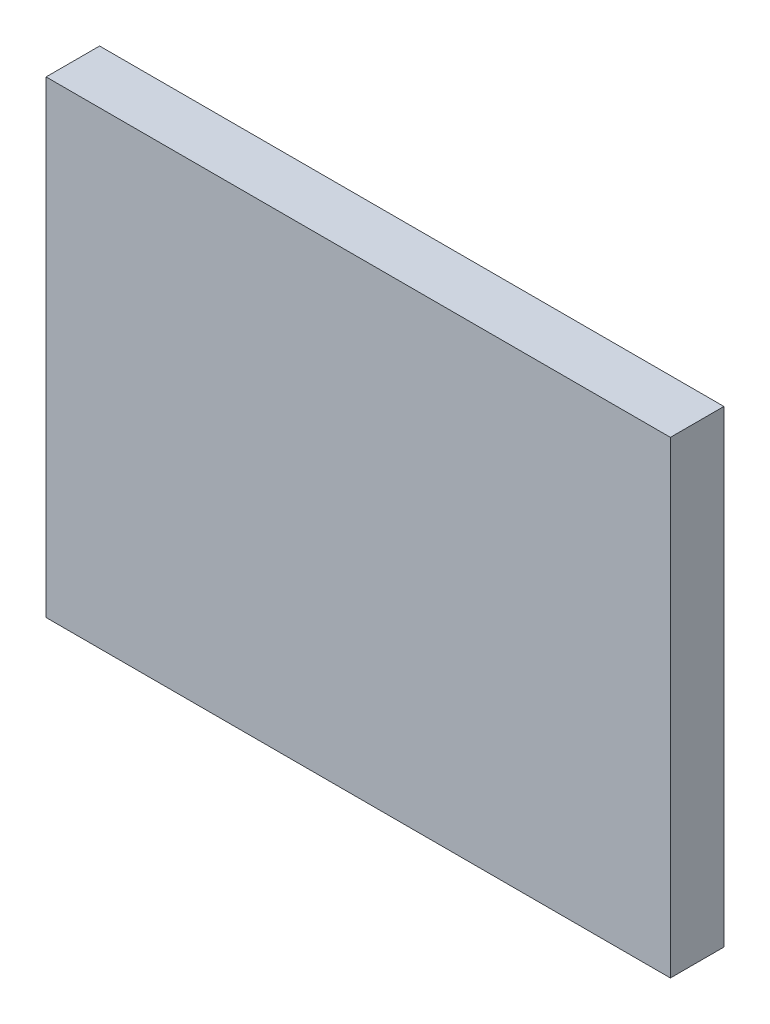
ISO-10303-21;
HEADER;
FILE_DESCRIPTION(('STEP AP214'),'2;1');
FILE_NAME('part.step','',(''),(''),'','','');
FILE_SCHEMA(('AUTOMOTIVE_DESIGN { 1 0 10303 214 1 1 1 1 }'));
ENDSEC;
DATA;
#1=APPLICATION_CONTEXT('core data for automotive mechanical design processes');
#2=APPLICATION_PROTOCOL_DEFINITION('international standard','automotive_design',2000,#1);
#3=PRODUCT_CONTEXT('',#1,'mechanical');
#4=PRODUCT('Part','Part','',(#3));
#5=PRODUCT_RELATED_PRODUCT_CATEGORY('part','',(#4));
#6=PRODUCT_DEFINITION_FORMATION('','',#4);
#7=PRODUCT_DEFINITION_CONTEXT('part definition',#1,'design');
#8=PRODUCT_DEFINITION('design','',#6,#7);
#9=PRODUCT_DEFINITION_SHAPE('','',#8);
#10=(LENGTH_UNIT() NAMED_UNIT(*) SI_UNIT(.MILLI.,.METRE.));
#11=(NAMED_UNIT(*) PLANE_ANGLE_UNIT() SI_UNIT($,.RADIAN.));
#12=(NAMED_UNIT(*) SI_UNIT($,.STERADIAN.) SOLID_ANGLE_UNIT());
#13=UNCERTAINTY_MEASURE_WITH_UNIT(LENGTH_MEASURE(1.E-05),#10,'distance_accuracy_value','');
#14=(GEOMETRIC_REPRESENTATION_CONTEXT(3) GLOBAL_UNCERTAINTY_ASSIGNED_CONTEXT((#13)) GLOBAL_UNIT_ASSIGNED_CONTEXT((#10,
#11,#12)) REPRESENTATION_CONTEXT('',''));
#15=CARTESIAN_POINT('',(0.,0.,0.));
#16=DIRECTION('',(0.,0.,1.));
#17=DIRECTION('',(1.,0.,0.));
#18=AXIS2_PLACEMENT_3D('',#15,#16,#17);
#19=CARTESIAN_POINT('',(3.15468,8.505108,0.76487));
#20=DIRECTION('',(0.,0.,-1.));
#21=DIRECTION('',(0.,1.,0.));
#22=AXIS2_PLACEMENT_3D('',#19,#20,#21);
#23=PLANE('',#22);
#24=DIRECTION('',(1.,0.,0.));
#25=VECTOR('',#24,1.);
#26=CARTESIAN_POINT('',(2.95468,8.655108,0.76487));
#27=LINE('',#26,#25);
#28=CARTESIAN_POINT('',(2.95468,8.655108,0.76487));
#29=VERTEX_POINT('',#28);
#30=CARTESIAN_POINT('',(3.35468,8.655108,0.76487));
#31=VERTEX_POINT('',#30);
#32=EDGE_CURVE('E55',#29,#31,#27,.T.);
#33=ORIENTED_EDGE('',*,*,#32,.T.);
#34=DIRECTION('',(0.,1.,0.));
#35=VECTOR('',#34,1.);
#36=CARTESIAN_POINT('',(3.35468,8.655108,0.76487));
#37=LINE('',#36,#35);
#38=CARTESIAN_POINT('',(3.35468,8.355108,0.76487));
#39=VERTEX_POINT('',#38);
#40=EDGE_CURVE('E57',#31,#39,#37,.F.);
#41=ORIENTED_EDGE('',*,*,#40,.T.);
#42=DIRECTION('',(1.,0.,0.));
#43=VECTOR('',#42,1.);
#44=CARTESIAN_POINT('',(3.35468,8.355108,0.76487));
#45=LINE('',#44,#43);
#46=CARTESIAN_POINT('',(2.95468,8.355108,0.76487));
#47=VERTEX_POINT('',#46);
#48=EDGE_CURVE('E20',#39,#47,#45,.F.);
#49=ORIENTED_EDGE('',*,*,#48,.T.);
#50=DIRECTION('',(0.,1.,0.));
#51=VECTOR('',#50,1.);
#52=CARTESIAN_POINT('',(2.95468,8.355108,0.76487));
#53=LINE('',#52,#51);
#54=EDGE_CURVE('E80',#47,#29,#53,.T.);
#55=ORIENTED_EDGE('',*,*,#54,.T.);
#56=EDGE_LOOP('',(#33,#41,#49,#55));
#57=FACE_BOUND('',#56,.T.);
#58=ADVANCED_FACE('F17',(#57),#23,.T.);
#59=CARTESIAN_POINT('',(3.35468,8.355108,0.76487));
#60=DIRECTION('',(0.,1.,0.));
#61=DIRECTION('',(0.,0.,1.));
#62=AXIS2_PLACEMENT_3D('',#59,#60,#61);
#63=PLANE('',#62);
#64=DIRECTION('',(0.,0.,-1.));
#65=VECTOR('',#64,1.);
#66=CARTESIAN_POINT('',(2.95468,8.355108,0.76487));
#67=LINE('',#66,#65);
#68=CARTESIAN_POINT('',(2.95468,8.355108,0.79916));
#69=VERTEX_POINT('',#68);
#70=EDGE_CURVE('E68',#69,#47,#67,.T.);
#71=ORIENTED_EDGE('',*,*,#70,.T.);
#72=ORIENTED_EDGE('',*,*,#48,.F.);
#73=DIRECTION('',(0.,0.,1.));
#74=VECTOR('',#73,1.);
#75=CARTESIAN_POINT('',(3.35468,8.355108,0.76487));
#76=LINE('',#75,#74);
#77=CARTESIAN_POINT('',(3.35468,8.355108,0.79916));
#78=VERTEX_POINT('',#77);
#79=EDGE_CURVE('E63',#39,#78,#76,.T.);
#80=ORIENTED_EDGE('',*,*,#79,.T.);
#81=DIRECTION('',(1.,0.,0.));
#82=VECTOR('',#81,1.);
#83=CARTESIAN_POINT('',(3.15468,8.355108,0.79916));
#84=LINE('',#83,#82);
#85=EDGE_CURVE('E83',#69,#78,#84,.T.);
#86=ORIENTED_EDGE('',*,*,#85,.F.);
#87=EDGE_LOOP('',(#71,#72,#80,#86));
#88=FACE_BOUND('',#87,.T.);
#89=ADVANCED_FACE('F65',(#88),#63,.F.);
#90=CARTESIAN_POINT('',(3.35468,8.655108,0.76487));
#91=DIRECTION('',(-1.,0.,0.));
#92=DIRECTION('',(0.,0.,1.));
#93=AXIS2_PLACEMENT_3D('',#90,#91,#92);
#94=PLANE('',#93);
#95=ORIENTED_EDGE('',*,*,#79,.F.);
#96=ORIENTED_EDGE('',*,*,#40,.F.);
#97=DIRECTION('',(0.,0.,-1.));
#98=VECTOR('',#97,1.);
#99=CARTESIAN_POINT('',(3.35468,8.655108,0.76487));
#100=LINE('',#99,#98);
#101=CARTESIAN_POINT('',(3.35468,8.655108,0.79916));
#102=VERTEX_POINT('',#101);
#103=EDGE_CURVE('E75',#31,#102,#100,.F.);
#104=ORIENTED_EDGE('',*,*,#103,.T.);
#105=DIRECTION('',(0.,-1.,0.));
#106=VECTOR('',#105,1.);
#107=CARTESIAN_POINT('',(3.35468,8.505108,0.79916));
#108=LINE('',#107,#106);
#109=EDGE_CURVE('E72',#78,#102,#108,.F.);
#110=ORIENTED_EDGE('',*,*,#109,.F.);
#111=EDGE_LOOP('',(#95,#96,#104,#110));
#112=FACE_BOUND('',#111,.T.);
#113=ADVANCED_FACE('F70',(#112),#94,.F.);
#114=CARTESIAN_POINT('',(2.95468,8.655108,0.76487));
#115=DIRECTION('',(0.,-1.,0.));
#116=DIRECTION('',(0.,0.,-1.));
#117=AXIS2_PLACEMENT_3D('',#114,#115,#116);
#118=PLANE('',#117);
#119=ORIENTED_EDGE('',*,*,#103,.F.);
#120=ORIENTED_EDGE('',*,*,#32,.F.);
#121=DIRECTION('',(0.,0.,-1.));
#122=VECTOR('',#121,1.);
#123=CARTESIAN_POINT('',(2.95468,8.655108,0.76487));
#124=LINE('',#123,#122);
#125=CARTESIAN_POINT('',(2.95468,8.655108,0.79916));
#126=VERTEX_POINT('',#125);
#127=EDGE_CURVE('E35',#29,#126,#124,.F.);
#128=ORIENTED_EDGE('',*,*,#127,.T.);
#129=DIRECTION('',(1.,0.,0.));
#130=VECTOR('',#129,1.);
#131=CARTESIAN_POINT('',(3.15468,8.655108,0.79916));
#132=LINE('',#131,#130);
#133=EDGE_CURVE('E26',#102,#126,#132,.F.);
#134=ORIENTED_EDGE('',*,*,#133,.F.);
#135=EDGE_LOOP('',(#119,#120,#128,#134));
#136=FACE_BOUND('',#135,.T.);
#137=ADVANCED_FACE('F89',(#136),#118,.F.);
#138=CARTESIAN_POINT('',(2.95468,8.355108,0.76487));
#139=DIRECTION('',(1.,0.,0.));
#140=DIRECTION('',(0.,0.,-1.));
#141=AXIS2_PLACEMENT_3D('',#138,#139,#140);
#142=PLANE('',#141);
#143=ORIENTED_EDGE('',*,*,#127,.F.);
#144=ORIENTED_EDGE('',*,*,#54,.F.);
#145=ORIENTED_EDGE('',*,*,#70,.F.);
#146=DIRECTION('',(0.,-1.,0.));
#147=VECTOR('',#146,1.);
#148=CARTESIAN_POINT('',(2.95468,8.505108,0.79916));
#149=LINE('',#148,#147);
#150=EDGE_CURVE('E11',#126,#69,#149,.T.);
#151=ORIENTED_EDGE('',*,*,#150,.F.);
#152=EDGE_LOOP('',(#143,#144,#145,#151));
#153=FACE_BOUND('',#152,.T.);
#154=ADVANCED_FACE('F91',(#153),#142,.F.);
#155=CARTESIAN_POINT('',(3.15468,8.505108,0.79916));
#156=DIRECTION('',(0.,0.,1.));
#157=DIRECTION('',(0.,-1.,0.));
#158=AXIS2_PLACEMENT_3D('',#155,#156,#157);
#159=PLANE('',#158);
#160=ORIENTED_EDGE('',*,*,#133,.T.);
#161=ORIENTED_EDGE('',*,*,#150,.T.);
#162=ORIENTED_EDGE('',*,*,#85,.T.);
#163=ORIENTED_EDGE('',*,*,#109,.T.);
#164=EDGE_LOOP('',(#160,#161,#162,#163));
#165=FACE_BOUND('',#164,.T.);
#166=ADVANCED_FACE('F88',(#165),#159,.T.);
#167=CLOSED_SHELL('',(#58,#89,#113,#137,#154,#166));
#168=MANIFOLD_SOLID_BREP('B1',#167);
#169=ADVANCED_BREP_SHAPE_REPRESENTATION('',(#18,#168),#14);
#170=SHAPE_DEFINITION_REPRESENTATION(#9,#169);
ENDSEC;
END-ISO-10303-21;
